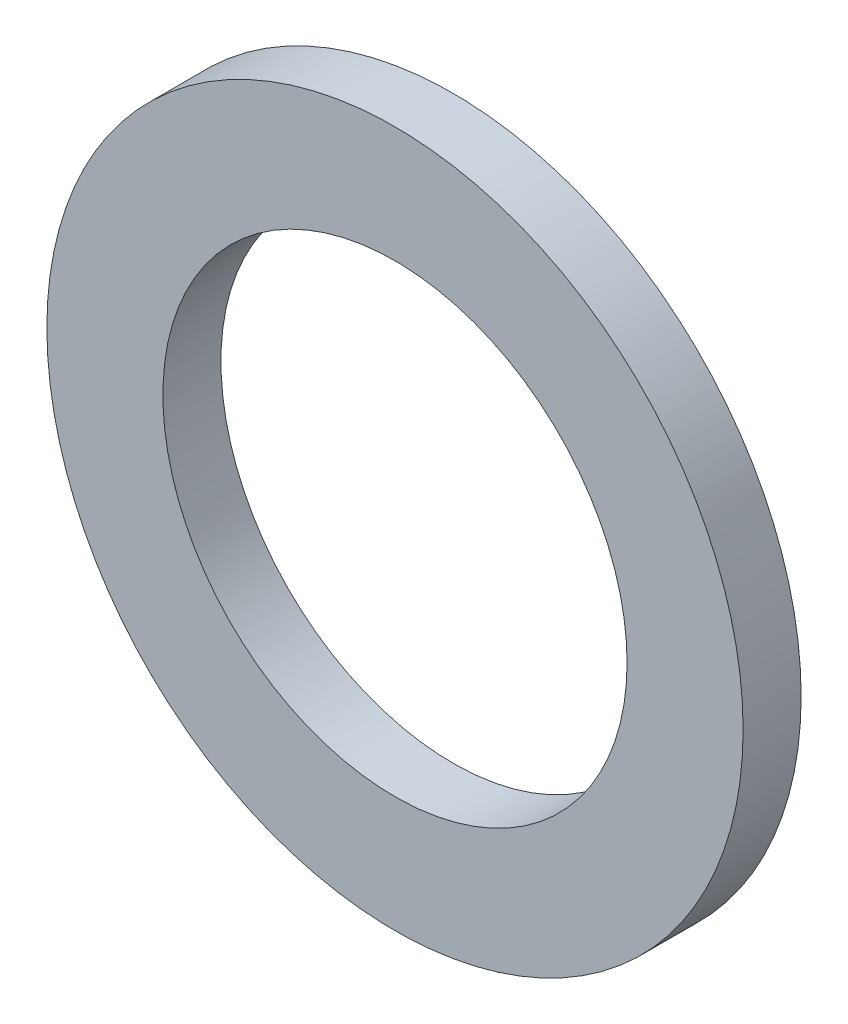
ISO-10303-21;
HEADER;
FILE_DESCRIPTION(('STEP AP214'),'2;1');
FILE_NAME('part.step','',(''),(''),'','','');
FILE_SCHEMA(('AUTOMOTIVE_DESIGN { 1 0 10303 214 1 1 1 1 }'));
ENDSEC;
DATA;
#1=APPLICATION_CONTEXT('core data for automotive mechanical design processes');
#2=APPLICATION_PROTOCOL_DEFINITION('international standard','automotive_design',2000,#1);
#3=PRODUCT_CONTEXT('',#1,'mechanical');
#4=PRODUCT('Part','Part','',(#3));
#5=PRODUCT_RELATED_PRODUCT_CATEGORY('part','',(#4));
#6=PRODUCT_DEFINITION_FORMATION('','',#4);
#7=PRODUCT_DEFINITION_CONTEXT('part definition',#1,'design');
#8=PRODUCT_DEFINITION('design','',#6,#7);
#9=PRODUCT_DEFINITION_SHAPE('','',#8);
#10=(LENGTH_UNIT() NAMED_UNIT(*) SI_UNIT(.MILLI.,.METRE.));
#11=(NAMED_UNIT(*) PLANE_ANGLE_UNIT() SI_UNIT($,.RADIAN.));
#12=(NAMED_UNIT(*) SI_UNIT($,.STERADIAN.) SOLID_ANGLE_UNIT());
#13=UNCERTAINTY_MEASURE_WITH_UNIT(LENGTH_MEASURE(1.E-05),#10,'distance_accuracy_value','');
#14=(GEOMETRIC_REPRESENTATION_CONTEXT(3) GLOBAL_UNCERTAINTY_ASSIGNED_CONTEXT((#13)) GLOBAL_UNIT_ASSIGNED_CONTEXT((#10,
#11,#12)) REPRESENTATION_CONTEXT('',''));
#15=CARTESIAN_POINT('',(0.,0.,0.));
#16=DIRECTION('',(0.,0.,1.));
#17=DIRECTION('',(1.,0.,0.));
#18=AXIS2_PLACEMENT_3D('',#15,#16,#17);
#19=CARTESIAN_POINT('',(0.,0.,1.5));
#20=DIRECTION('',(0.,0.,1.));
#21=DIRECTION('',(1.,0.,0.));
#22=AXIS2_PLACEMENT_3D('',#19,#20,#21);
#23=PLANE('',#22);
#24=CARTESIAN_POINT('',(0.,0.,1.5));
#25=DIRECTION('',(0.,0.,1.));
#26=DIRECTION('',(1.,0.,0.));
#27=AXIS2_PLACEMENT_3D('',#24,#25,#26);
#28=CIRCLE('',#27,9.);
#29=CARTESIAN_POINT('',(9.,0.,1.5));
#30=VERTEX_POINT('',#29);
#31=EDGE_CURVE('E10',#30,#30,#28,.T.);
#32=ORIENTED_EDGE('',*,*,#31,.T.);
#33=EDGE_LOOP('',(#32));
#34=FACE_BOUND('',#33,.T.);
#35=CARTESIAN_POINT('',(0.,0.,1.5));
#36=DIRECTION('',(0.,0.,1.));
#37=DIRECTION('',(1.,0.,0.));
#38=AXIS2_PLACEMENT_3D('',#35,#36,#37);
#39=CIRCLE('',#38,6.);
#40=CARTESIAN_POINT('',(6.,0.,1.5));
#41=VERTEX_POINT('',#40);
#42=EDGE_CURVE('E39',#41,#41,#39,.T.);
#43=ORIENTED_EDGE('',*,*,#42,.F.);
#44=EDGE_LOOP('',(#43));
#45=FACE_BOUND('',#44,.T.);
#46=ADVANCED_FACE('F28',(#34,#45),#23,.T.);
#47=CARTESIAN_POINT('',(0.,0.,0.));
#48=DIRECTION('',(0.,0.,1.));
#49=DIRECTION('',(1.,0.,0.));
#50=AXIS2_PLACEMENT_3D('',#47,#48,#49);
#51=PLANE('',#50);
#52=CARTESIAN_POINT('',(0.,0.,0.));
#53=DIRECTION('',(0.,0.,1.));
#54=DIRECTION('',(1.,0.,0.));
#55=AXIS2_PLACEMENT_3D('',#52,#53,#54);
#56=CIRCLE('',#55,9.);
#57=CARTESIAN_POINT('',(9.,0.,0.));
#58=VERTEX_POINT('',#57);
#59=EDGE_CURVE('E32',#58,#58,#56,.T.);
#60=ORIENTED_EDGE('',*,*,#59,.F.);
#61=EDGE_LOOP('',(#60));
#62=FACE_BOUND('',#61,.T.);
#63=CARTESIAN_POINT('',(0.,0.,0.));
#64=DIRECTION('',(0.,0.,1.));
#65=DIRECTION('',(1.,0.,0.));
#66=AXIS2_PLACEMENT_3D('',#63,#64,#65);
#67=CIRCLE('',#66,6.);
#68=CARTESIAN_POINT('',(6.,0.,0.));
#69=VERTEX_POINT('',#68);
#70=EDGE_CURVE('E41',#69,#69,#67,.T.);
#71=ORIENTED_EDGE('',*,*,#70,.T.);
#72=EDGE_LOOP('',(#71));
#73=FACE_BOUND('',#72,.T.);
#74=ADVANCED_FACE('F51',(#62,#73),#51,.F.);
#75=CARTESIAN_POINT('',(0.,0.,1.5));
#76=DIRECTION('',(0.,0.,-1.));
#77=DIRECTION('',(-1.,0.,0.));
#78=AXIS2_PLACEMENT_3D('',#75,#76,#77);
#79=CYLINDRICAL_SURFACE('',#78,9.);
#80=ORIENTED_EDGE('',*,*,#31,.F.);
#81=EDGE_LOOP('',(#80));
#82=FACE_BOUND('',#81,.T.);
#83=ORIENTED_EDGE('',*,*,#59,.T.);
#84=EDGE_LOOP('',(#83));
#85=FACE_BOUND('',#84,.T.);
#86=ADVANCED_FACE('F30',(#82,#85),#79,.T.);
#87=CARTESIAN_POINT('',(0.,0.,1.5));
#88=DIRECTION('',(0.,0.,-1.));
#89=DIRECTION('',(-1.,0.,0.));
#90=AXIS2_PLACEMENT_3D('',#87,#88,#89);
#91=CYLINDRICAL_SURFACE('',#90,6.);
#92=ORIENTED_EDGE('',*,*,#42,.T.);
#93=EDGE_LOOP('',(#92));
#94=FACE_BOUND('',#93,.T.);
#95=ORIENTED_EDGE('',*,*,#70,.F.);
#96=EDGE_LOOP('',(#95));
#97=FACE_BOUND('',#96,.T.);
#98=ADVANCED_FACE('F47',(#94,#97),#91,.F.);
#99=CLOSED_SHELL('',(#46,#74,#86,#98));
#100=MANIFOLD_SOLID_BREP('B2',#99);
#101=ADVANCED_BREP_SHAPE_REPRESENTATION('',(#18,#100),#14);
#102=SHAPE_DEFINITION_REPRESENTATION(#9,#101);
ENDSEC;
END-ISO-10303-21;
